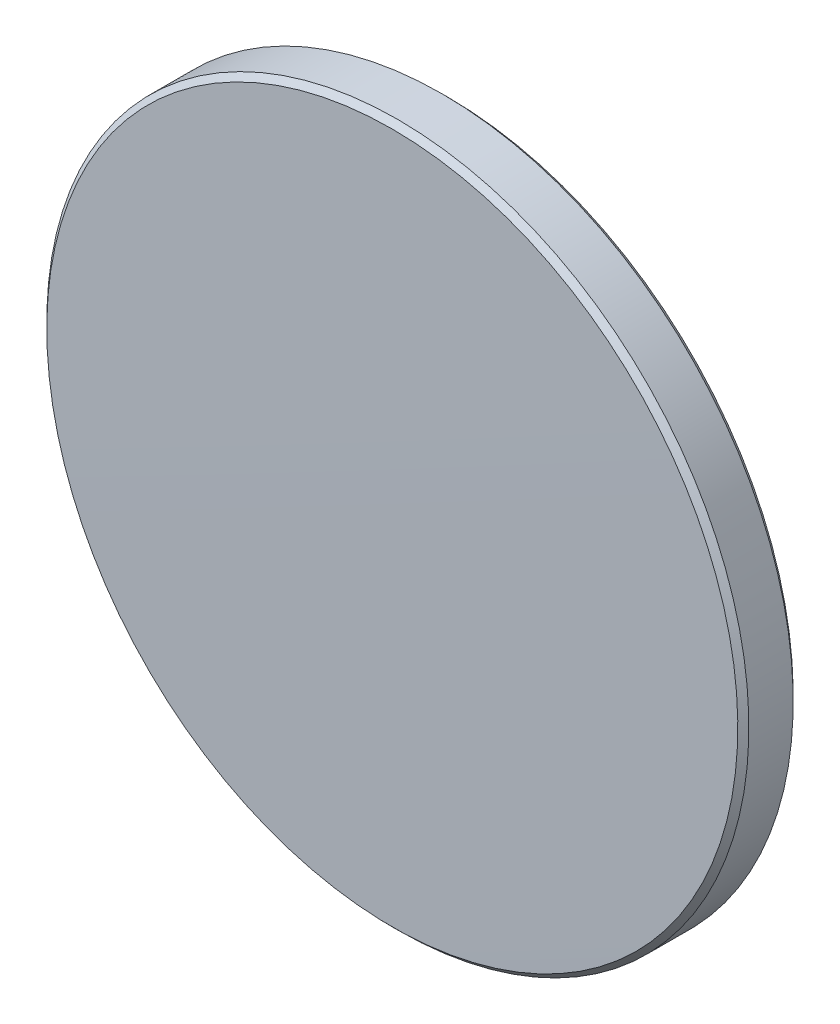
ISO-10303-21;
HEADER;
FILE_DESCRIPTION(('STEP AP214'),'2;1');
FILE_NAME('part.step','',(''),(''),'','','');
FILE_SCHEMA(('AUTOMOTIVE_DESIGN { 1 0 10303 214 1 1 1 1 }'));
ENDSEC;
DATA;
#1=APPLICATION_CONTEXT('core data for automotive mechanical design processes');
#2=APPLICATION_PROTOCOL_DEFINITION('international standard','automotive_design',2000,#1);
#3=PRODUCT_CONTEXT('',#1,'mechanical');
#4=PRODUCT('Part','Part','',(#3));
#5=PRODUCT_RELATED_PRODUCT_CATEGORY('part','',(#4));
#6=PRODUCT_DEFINITION_FORMATION('','',#4);
#7=PRODUCT_DEFINITION_CONTEXT('part definition',#1,'design');
#8=PRODUCT_DEFINITION('design','',#6,#7);
#9=PRODUCT_DEFINITION_SHAPE('','',#8);
#10=(LENGTH_UNIT() NAMED_UNIT(*) SI_UNIT(.MILLI.,.METRE.));
#11=(NAMED_UNIT(*) PLANE_ANGLE_UNIT() SI_UNIT($,.RADIAN.));
#12=(NAMED_UNIT(*) SI_UNIT($,.STERADIAN.) SOLID_ANGLE_UNIT());
#13=UNCERTAINTY_MEASURE_WITH_UNIT(LENGTH_MEASURE(1.E-05),#10,'distance_accuracy_value','');
#14=(GEOMETRIC_REPRESENTATION_CONTEXT(3) GLOBAL_UNCERTAINTY_ASSIGNED_CONTEXT((#13)) GLOBAL_UNIT_ASSIGNED_CONTEXT((#10,
#11,#12)) REPRESENTATION_CONTEXT('',''));
#15=CARTESIAN_POINT('',(0.,0.,0.));
#16=DIRECTION('',(0.,0.,1.));
#17=DIRECTION('',(1.,0.,0.));
#18=AXIS2_PLACEMENT_3D('',#15,#16,#17);
#19=CARTESIAN_POINT('',(0.,0.,-1.03));
#20=DIRECTION('',(0.,0.,-1.));
#21=DIRECTION('',(0.,1.,0.));
#22=AXIS2_PLACEMENT_3D('',#19,#20,#21);
#23=CYLINDRICAL_SURFACE('',#22,12.7);
#24=CARTESIAN_POINT('',(0.,3.00684512098474E-13,0.774301227827052));
#25=DIRECTION('',(0.,-1.66648732185696E-13,-1.));
#26=DIRECTION('',(0.,1.,-1.66648732185696E-13));
#27=AXIS2_PLACEMENT_3D('',#24,#25,#26);
#28=CIRCLE('',#27,12.6999999999997);
#29=CARTESIAN_POINT('',(0.,12.7,0.774301227824936));
#30=VERTEX_POINT('',#29);
#31=EDGE_CURVE('E24',#30,#30,#28,.T.);
#32=ORIENTED_EDGE('',*,*,#31,.T.);
#33=EDGE_LOOP('',(#32));
#34=FACE_BOUND('',#33,.T.);
#35=CARTESIAN_POINT('',(0.,0.,-0.829999999997884));
#36=DIRECTION('',(0.,-1.66648732185696E-13,-1.));
#37=DIRECTION('',(0.,1.,-1.66648732185696E-13));
#38=AXIS2_PLACEMENT_3D('',#35,#36,#37);
#39=CIRCLE('',#38,12.7);
#40=CARTESIAN_POINT('',(0.,12.7,-0.83));
#41=VERTEX_POINT('',#40);
#42=EDGE_CURVE('E20',#41,#41,#39,.T.);
#43=ORIENTED_EDGE('',*,*,#42,.F.);
#44=EDGE_LOOP('',(#43));
#45=FACE_BOUND('',#44,.T.);
#46=ADVANCED_FACE('F13',(#34,#45),#23,.T.);
#47=CARTESIAN_POINT('',(0.,0.,-0.829999999997884));
#48=DIRECTION('',(0.,1.66648732185696E-13,1.));
#49=DIRECTION('',(0.,-1.,1.66648732185696E-13));
#50=AXIS2_PLACEMENT_3D('',#47,#48,#49);
#51=CONICAL_SURFACE('',#50,12.7,0.785398163397265);
#52=CARTESIAN_POINT('',(0.,0.,-1.02999999999792));
#53=DIRECTION('',(0.,-1.66648732185696E-13,-1.));
#54=DIRECTION('',(0.,1.,-1.66648732185696E-13));
#55=AXIS2_PLACEMENT_3D('',#52,#53,#54);
#56=CIRCLE('',#55,12.5);
#57=CARTESIAN_POINT('',(0.,12.5,-1.03000000000001));
#58=VERTEX_POINT('',#57);
#59=EDGE_CURVE('E9',#58,#58,#56,.T.);
#60=ORIENTED_EDGE('',*,*,#59,.F.);
#61=EDGE_LOOP('',(#60));
#62=FACE_BOUND('',#61,.T.);
#63=ORIENTED_EDGE('',*,*,#42,.T.);
#64=EDGE_LOOP('',(#63));
#65=FACE_BOUND('',#64,.T.);
#66=ADVANCED_FACE('F46',(#62,#65),#51,.T.);
#67=CARTESIAN_POINT('',(0.,0.,-1.03));
#68=DIRECTION('',(0.,0.,-1.));
#69=DIRECTION('',(0.,1.,0.));
#70=AXIS2_PLACEMENT_3D('',#67,#68,#69);
#71=PLANE('',#70);
#72=ORIENTED_EDGE('',*,*,#59,.T.);
#73=EDGE_LOOP('',(#72));
#74=FACE_BOUND('',#73,.T.);
#75=ADVANCED_FACE('F15',(#74),#71,.T.);
#76=CARTESIAN_POINT('',(0.,3.34014258535608E-13,0.974301227827019));
#77=DIRECTION('',(0.,-1.66648732185696E-13,-1.));
#78=DIRECTION('',(0.,1.,-1.66648732185696E-13));
#79=AXIS2_PLACEMENT_3D('',#76,#77,#78);
#80=CONICAL_SURFACE('',#79,12.4999999999997,0.785398163397619);
#81=ORIENTED_EDGE('',*,*,#31,.F.);
#82=EDGE_LOOP('',(#81));
#83=FACE_BOUND('',#82,.T.);
#84=CARTESIAN_POINT('',(0.,3.34014258535608E-13,0.974301227827019));
#85=DIRECTION('',(0.,-1.66648732185696E-13,-1.));
#86=DIRECTION('',(0.,1.,-1.66648732185696E-13));
#87=AXIS2_PLACEMENT_3D('',#84,#85,#86);
#88=CIRCLE('',#87,12.4999999999997);
#89=CARTESIAN_POINT('',(0.,12.5,0.974301227824936));
#90=VERTEX_POINT('',#89);
#91=EDGE_CURVE('E28',#90,#90,#88,.T.);
#92=ORIENTED_EDGE('',*,*,#91,.T.);
#93=EDGE_LOOP('',(#92));
#94=FACE_BOUND('',#93,.T.);
#95=ADVANCED_FACE('F34',(#83,#94),#80,.T.);
#96=CARTESIAN_POINT('',(0.,1.71519835443987E-13,-1401.632));
#97=DIRECTION('',(0.,0.,-1.));
#98=DIRECTION('',(0.,1.,0.));
#99=AXIS2_PLACEMENT_3D('',#96,#97,#98);
#100=SPHERICAL_SURFACE('',#99,1402.662);
#101=ORIENTED_EDGE('',*,*,#91,.F.);
#102=EDGE_LOOP('',(#101));
#103=FACE_BOUND('',#102,.T.);
#104=ADVANCED_FACE('F36',(#103),#100,.T.);
#105=CLOSED_SHELL('',(#46,#66,#75,#95,#104));
#106=MANIFOLD_SOLID_BREP('B1',#105);
#107=ADVANCED_BREP_SHAPE_REPRESENTATION('',(#18,#106),#14);
#108=SHAPE_DEFINITION_REPRESENTATION(#9,#107);
ENDSEC;
END-ISO-10303-21;
